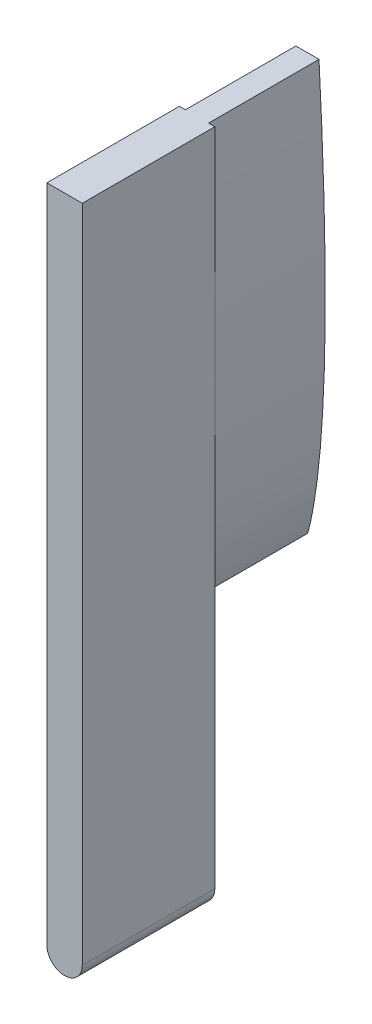
ISO-10303-21;
HEADER;
FILE_DESCRIPTION(('STEP AP214'),'2;1');
FILE_NAME('part.step','',(''),(''),'','','');
FILE_SCHEMA(('AUTOMOTIVE_DESIGN { 1 0 10303 214 1 1 1 1 }'));
ENDSEC;
DATA;
#1=APPLICATION_CONTEXT('core data for automotive mechanical design processes');
#2=APPLICATION_PROTOCOL_DEFINITION('international standard','automotive_design',2000,#1);
#3=PRODUCT_CONTEXT('',#1,'mechanical');
#4=PRODUCT('Part','Part','',(#3));
#5=PRODUCT_RELATED_PRODUCT_CATEGORY('part','',(#4));
#6=PRODUCT_DEFINITION_FORMATION('','',#4);
#7=PRODUCT_DEFINITION_CONTEXT('part definition',#1,'design');
#8=PRODUCT_DEFINITION('design','',#6,#7);
#9=PRODUCT_DEFINITION_SHAPE('','',#8);
#10=(LENGTH_UNIT() NAMED_UNIT(*) SI_UNIT(.MILLI.,.METRE.));
#11=(NAMED_UNIT(*) PLANE_ANGLE_UNIT() SI_UNIT($,.RADIAN.));
#12=(NAMED_UNIT(*) SI_UNIT($,.STERADIAN.) SOLID_ANGLE_UNIT());
#13=UNCERTAINTY_MEASURE_WITH_UNIT(LENGTH_MEASURE(1.E-05),#10,'distance_accuracy_value','');
#14=(GEOMETRIC_REPRESENTATION_CONTEXT(3) GLOBAL_UNCERTAINTY_ASSIGNED_CONTEXT((#13)) GLOBAL_UNIT_ASSIGNED_CONTEXT((#10,
#11,#12)) REPRESENTATION_CONTEXT('',''));
#15=CARTESIAN_POINT('',(0.,0.,0.));
#16=DIRECTION('',(0.,0.,1.));
#17=DIRECTION('',(1.,0.,0.));
#18=AXIS2_PLACEMENT_3D('',#15,#16,#17);
#19=CARTESIAN_POINT('',(0.0298945542330487,602.999999999983,24.6313387531903));
#20=DIRECTION('',(0.,0.,-1.));
#21=DIRECTION('',(-1.,0.,0.));
#22=AXIS2_PLACEMENT_3D('',#19,#20,#21);
#23=PLANE('',#22);
#24=CARTESIAN_POINT('',(0.0409976345272383,625.076764298735,24.6313387531903));
#25=CARTESIAN_POINT('',(-0.0708409013817099,625.459248904981,24.6313387531903));
#26=CARTESIAN_POINT('',(-0.163415051881224,625.843948539452,24.6313387531903));
#27=CARTESIAN_POINT('',(-0.33153675014114,626.615305535302,24.6313387531903));
#28=CARTESIAN_POINT('',(-0.406338832177334,627.002048610685,24.6313387531903));
#29=CARTESIAN_POINT('',(-0.614008944417072,628.164202165491,24.6313387531903));
#30=CARTESIAN_POINT('',(-0.728805434879599,628.941690519176,24.6313387531903));
#31=CARTESIAN_POINT('',(-1.02951816560601,631.279177552711,24.6313387531903));
#32=CARTESIAN_POINT('',(-1.16831944879958,632.844593532805,24.6313387531903));
#33=CARTESIAN_POINT('',(-1.37765882978531,635.98327442662,24.6313387531903));
#34=CARTESIAN_POINT('',(-1.4480325647783,637.557347723028,24.6313387531903));
#35=CARTESIAN_POINT('',(-1.54189304231198,640.707003282898,24.6313387531903));
#36=CARTESIAN_POINT('',(-1.56544765614516,642.28191223816,24.6313387531903));
#37=CARTESIAN_POINT('',(-1.58360924526535,647.006821425807,24.6313387531903));
#38=CARTESIAN_POINT('',(-1.52623600884216,650.157618772716,24.6313387531903));
#39=CARTESIAN_POINT('',(-1.33237645711837,656.455957524906,24.6313387531903));
#40=CARTESIAN_POINT('',(-1.19380236365322,659.603511067183,24.6313387531903));
#41=CARTESIAN_POINT('',(-1.02779046396842,662.749999999983,24.6313387531903));
#42=B_SPLINE_CURVE_WITH_KNOTS('',3,(#24,#25,#26,#27,#28,#29,#30,#31,#32,#33,#34,#35,#36,#37,#38,
#39,#40,#41),.UNSPECIFIED.,.F.,.F.,(4,2,2,2,2,2,2,2,4),(0.,0.0312500000000041,
0.0625000000000081,0.125000000000008,0.250000000000007,0.375000000000005,0.500000000000004,
0.750000000000002,1.),.UNSPECIFIED.);
#43=CARTESIAN_POINT('',(-1.02779046396842,662.749999999983,24.6313387531902));
#44=VERTEX_POINT('',#43);
#45=CARTESIAN_POINT('',(-1.57306805764736,644.82352516353,24.6313387531902));
#46=VERTEX_POINT('',#45);
#47=EDGE_CURVE('E230',#44,#46,#42,.F.);
#48=ORIENTED_EDGE('',*,*,#47,.T.);
#49=DIRECTION('',(0.,-1.,0.));
#50=VECTOR('',#49,1.);
#51=CARTESIAN_POINT('',(-1.57306805764735,662.749999999983,24.6313387531902));
#52=LINE('',#51,#50);
#53=CARTESIAN_POINT('',(-1.57306805764735,662.749999999983,24.6313387531902));
#54=VERTEX_POINT('',#53);
#55=EDGE_CURVE('E139',#54,#46,#52,.T.);
#56=ORIENTED_EDGE('',*,*,#55,.F.);
#57=DIRECTION('',(-1.,0.,0.));
#58=VECTOR('',#57,1.);
#59=CARTESIAN_POINT('',(1.63285716611346,662.749999999983,24.6313387531902));
#60=LINE('',#59,#58);
#61=EDGE_CURVE('E143',#44,#54,#60,.T.);
#62=ORIENTED_EDGE('',*,*,#61,.F.);
#63=EDGE_LOOP('',(#48,#56,#62));
#64=FACE_BOUND('',#63,.T.);
#65=ADVANCED_FACE('F35',(#64),#23,.T.);
#66=CARTESIAN_POINT('',(1.06690047121905,662.749999999983,24.6313387531903));
#67=CARTESIAN_POINT('',(1.23650385175241,659.603485125921,24.6313387531903));
#68=CARTESIAN_POINT('',(1.37867081888815,656.455796636478,24.6313387531903));
#69=CARTESIAN_POINT('',(1.57969897015707,650.156856183506,24.6313387531903));
#70=CARTESIAN_POINT('',(1.64064416120639,647.006539015094,24.6313387531903));
#71=CARTESIAN_POINT('',(1.62779363735582,642.280065577221,24.6313387531903));
#72=CARTESIAN_POINT('',(1.60596701321061,640.704411435351,24.6313387531903));
#73=CARTESIAN_POINT('',(1.51576118029368,637.558590500096,24.6313387531903));
#74=CARTESIAN_POINT('',(1.44733954392402,635.987803898651,24.6313387531903));
#75=CARTESIAN_POINT('',(1.24195574463996,632.85247335861,24.6313387531903));
#76=CARTESIAN_POINT('',(1.10520878535501,631.287909819293,24.6313387531903));
#77=CARTESIAN_POINT('',(0.807374158956095,628.949508907273,24.6313387531903));
#78=CARTESIAN_POINT('',(0.693510345911493,628.171370391667,24.6313387531903));
#79=CARTESIAN_POINT('',(0.487056781908678,627.007410330405,24.6313387531903));
#80=CARTESIAN_POINT('',(0.412632367849736,626.619934288067,24.6313387531903));
#81=CARTESIAN_POINT('',(0.245133832844769,625.846680816435,24.6313387531903));
#82=CARTESIAN_POINT('',(0.152824443736055,625.460833735457,24.6313387531903));
#83=CARTESIAN_POINT('',(0.0409976345273616,625.076764298736,24.6313387531903));
#84=B_SPLINE_CURVE_WITH_KNOTS('',3,(#66,#67,#68,#69,#70,#71,#72,#73,#74,#75,#76,#77,#78,#79,#80,
#81,#82,#83),.UNSPECIFIED.,.F.,.F.,(4,2,2,2,2,2,2,2,4),(0.,0.249999999999998,0.499999999999996,
0.624999999999995,0.749999999999994,0.874999999999992,0.937499999999992,0.968749999999996,1.),.UNSPECIFIED.);
#85=CARTESIAN_POINT('',(1.63285716611346,644.537559857474,24.6313387531902));
#86=VERTEX_POINT('',#85);
#87=CARTESIAN_POINT('',(1.06690047121905,662.749999999983,24.6313387531902));
#88=VERTEX_POINT('',#87);
#89=EDGE_CURVE('E47',#86,#88,#84,.F.);
#90=ORIENTED_EDGE('',*,*,#89,.T.);
#91=CARTESIAN_POINT('',(1.63285716611346,662.749999999983,24.6313387531902));
#92=VERTEX_POINT('',#91);
#93=EDGE_CURVE('E145',#92,#88,#60,.T.);
#94=ORIENTED_EDGE('',*,*,#93,.F.);
#95=DIRECTION('',(0.,1.,0.));
#96=VECTOR('',#95,1.);
#97=CARTESIAN_POINT('',(1.63285716611346,602.999999999983,24.6313387531902));
#98=LINE('',#97,#96);
#99=EDGE_CURVE('E138',#86,#92,#98,.T.);
#100=ORIENTED_EDGE('',*,*,#99,.F.);
#101=EDGE_LOOP('',(#90,#94,#100));
#102=FACE_BOUND('',#101,.T.);
#103=ADVANCED_FACE('F228',(#102),#23,.T.);
#104=CARTESIAN_POINT('',(0.0298945542330487,602.999999999983,24.6313387531902));
#105=DIRECTION('',(0.,0.,-1.));
#106=DIRECTION('',(-1.,0.,0.));
#107=AXIS2_PLACEMENT_3D('',#104,#105,#106);
#108=CIRCLE('',#107,1.60296261188041);
#109=CARTESIAN_POINT('',(-1.57306805764736,602.999999999983,24.6313387531902));
#110=VERTEX_POINT('',#109);
#111=CARTESIAN_POINT('',(1.63285716611346,602.999999999983,24.6313387531902));
#112=VERTEX_POINT('',#111);
#113=EDGE_CURVE('E133',#110,#112,#108,.F.);
#114=ORIENTED_EDGE('',*,*,#113,.F.);
#115=CARTESIAN_POINT('',(-1.57306805764736,644.569367318791,24.6313387531902));
#116=VERTEX_POINT('',#115);
#117=EDGE_CURVE('E314',#116,#110,#52,.T.);
#118=ORIENTED_EDGE('',*,*,#117,.F.);
#119=CARTESIAN_POINT('',(0.0409976345272383,625.076764298735,24.6313387531903));
#120=VERTEX_POINT('',#119);
#121=EDGE_CURVE('E235',#116,#120,#42,.F.);
#122=ORIENTED_EDGE('',*,*,#121,.T.);
#123=CARTESIAN_POINT('',(1.63285716611346,644.35458168479,24.6313387531902));
#124=VERTEX_POINT('',#123);
#125=EDGE_CURVE('E11',#120,#124,#84,.F.);
#126=ORIENTED_EDGE('',*,*,#125,.T.);
#127=EDGE_CURVE('E124',#112,#124,#98,.T.);
#128=ORIENTED_EDGE('',*,*,#127,.F.);
#129=EDGE_LOOP('',(#114,#118,#122,#126,#128));
#130=FACE_BOUND('',#129,.T.);
#131=ADVANCED_FACE('F141',(#130),#23,.T.);
#132=CARTESIAN_POINT('',(0.0409976345272383,625.076764298735,72.9938664508114));
#133=CARTESIAN_POINT('',(-0.0708409013817099,625.459248904981,72.9938664508114));
#134=CARTESIAN_POINT('',(-0.163415051881224,625.843948539452,72.9938664508114));
#135=CARTESIAN_POINT('',(-0.33153675014114,626.615305535302,72.9938664508114));
#136=CARTESIAN_POINT('',(-0.406338832177334,627.002048610685,72.9938664508114));
#137=CARTESIAN_POINT('',(-0.614008944417072,628.164202165491,72.9938664508114));
#138=CARTESIAN_POINT('',(-0.728805434879599,628.941690519176,72.9938664508114));
#139=CARTESIAN_POINT('',(-1.02951816560601,631.279177552711,72.9938664508114));
#140=CARTESIAN_POINT('',(-1.16831944879958,632.844593532805,72.9938664508114));
#141=CARTESIAN_POINT('',(-1.37765882978531,635.98327442662,72.9938664508114));
#142=CARTESIAN_POINT('',(-1.4480325647783,637.557347723028,72.9938664508114));
#143=CARTESIAN_POINT('',(-1.54189304231198,640.707003282898,72.9938664508114));
#144=CARTESIAN_POINT('',(-1.56544765614516,642.28191223816,72.9938664508114));
#145=CARTESIAN_POINT('',(-1.58360924526535,647.006821425807,72.9938664508114));
#146=CARTESIAN_POINT('',(-1.52623600884216,650.157618772716,72.9938664508114));
#147=CARTESIAN_POINT('',(-1.33237645711837,656.455957524906,72.9938664508114));
#148=CARTESIAN_POINT('',(-1.19380236365322,659.603511067183,72.9938664508114));
#149=CARTESIAN_POINT('',(-1.02779046396842,662.749999999983,72.9938664508114));
#150=B_SPLINE_CURVE_WITH_KNOTS('',3,(#132,#133,#134,#135,#136,#137,#138,#139,#140,#141,#142,
#143,#144,#145,#146,#147,#148,#149),.UNSPECIFIED.,.F.,.F.,(4,2,2,2,2,2,2,2,4),(0.,
0.0312500000000041,0.0625000000000081,0.125000000000008,0.250000000000007,0.375000000000005,
0.500000000000004,0.750000000000002,1.),.UNSPECIFIED.);
#151=DIRECTION('',(0.,0.,-1.));
#152=VECTOR('',#151,1.);
#153=SURFACE_OF_LINEAR_EXTRUSION('',#150,#152);
#154=DIRECTION('',(0.,0.,-1.));
#155=VECTOR('',#154,1.);
#156=CARTESIAN_POINT('',(-1.02779046396842,662.749999999983,72.9938664508114));
#157=LINE('',#156,#155);
#158=CARTESIAN_POINT('',(-1.02779046396842,662.749999999983,14.6313387531903));
#159=VERTEX_POINT('',#158);
#160=EDGE_CURVE('E236',#44,#159,#157,.T.);
#161=ORIENTED_EDGE('',*,*,#160,.T.);
#162=CARTESIAN_POINT('',(-1.02779046396842,662.749999999983,14.6313387531903));
#163=CARTESIAN_POINT('',(-1.19380236365322,659.603511067183,14.6313387531903));
#164=CARTESIAN_POINT('',(-1.33237645711837,656.455957524906,14.6313387531903));
#165=CARTESIAN_POINT('',(-1.52623600884216,650.157618772716,14.6313387531903));
#166=CARTESIAN_POINT('',(-1.58360924526535,647.006821425807,14.6313387531903));
#167=CARTESIAN_POINT('',(-1.56544765614516,642.28191223816,14.6313387531903));
#168=CARTESIAN_POINT('',(-1.54189304231198,640.707003282898,14.6313387531903));
#169=CARTESIAN_POINT('',(-1.4480325647783,637.557347723028,14.6313387531903));
#170=CARTESIAN_POINT('',(-1.37765882978531,635.98327442662,14.6313387531903));
#171=CARTESIAN_POINT('',(-1.16831944879958,632.844593532805,14.6313387531903));
#172=CARTESIAN_POINT('',(-1.02951816560601,631.279177552711,14.6313387531903));
#173=CARTESIAN_POINT('',(-0.728805434879599,628.941690519176,14.6313387531903));
#174=CARTESIAN_POINT('',(-0.614008944417072,628.164202165491,14.6313387531903));
#175=CARTESIAN_POINT('',(-0.406338832177334,627.002048610685,14.6313387531903));
#176=CARTESIAN_POINT('',(-0.33153675014114,626.615305535302,14.6313387531903));
#177=CARTESIAN_POINT('',(-0.163415051881224,625.843948539452,14.6313387531903));
#178=CARTESIAN_POINT('',(-0.0708409013817099,625.459248904981,14.6313387531903));
#179=CARTESIAN_POINT('',(0.0409976345272383,625.076764298735,14.6313387531903));
#180=B_SPLINE_CURVE_WITH_KNOTS('',3,(#162,#163,#164,#165,#166,#167,#168,#169,#170,#171,#172,
#173,#174,#175,#176,#177,#178,#179),.UNSPECIFIED.,.F.,.F.,(4,2,2,2,2,2,2,2,4),(0.,
0.249999999999998,0.499999999999996,0.624999999999995,0.749999999999993,0.874999999999992,
0.937499999999992,0.968749999999996,1.),.UNSPECIFIED.);
#181=CARTESIAN_POINT('',(0.0409976345273616,625.076764298736,14.6313387531903));
#182=VERTEX_POINT('',#181);
#183=EDGE_CURVE('E217',#182,#159,#180,.F.);
#184=ORIENTED_EDGE('',*,*,#183,.F.);
#185=DIRECTION('',(0.,0.,-1.));
#186=VECTOR('',#185,1.);
#187=CARTESIAN_POINT('',(0.0409976345272383,625.076764298735,72.9938664508114));
#188=LINE('',#187,#186);
#189=EDGE_CURVE('E239',#120,#182,#188,.T.);
#190=ORIENTED_EDGE('',*,*,#189,.F.);
#191=ORIENTED_EDGE('',*,*,#121,.F.);
#192=CARTESIAN_POINT('',(-1.57306805764736,644.57029770419,24.6313387531902));
#193=VERTEX_POINT('',#192);
#194=EDGE_CURVE('E214',#193,#116,#52,.T.);
#195=ORIENTED_EDGE('',*,*,#194,.F.);
#196=CARTESIAN_POINT('',(-1.57306858755521,644.57029770404,24.6313387531903));
#197=CARTESIAN_POINT('',(-1.57311631046774,644.65439739438,24.6313387531903));
#198=CARTESIAN_POINT('',(-1.57311611930975,644.738497562438,24.6313387531903));
#199=CARTESIAN_POINT('',(-1.57306858352999,644.822598160908,24.6313387531903));
#200=B_SPLINE_CURVE_WITH_KNOTS('',3,(#196,#197,#198,#199),.UNSPECIFIED.,.F.,.F.,(4,4),
(0.518873435176188,0.525547897615271),.UNSPECIFIED.);
#201=CARTESIAN_POINT('',(-1.57306805764736,644.822598160759,24.6313387531902));
#202=VERTEX_POINT('',#201);
#203=EDGE_CURVE('E209',#202,#193,#200,.F.);
#204=ORIENTED_EDGE('',*,*,#203,.F.);
#205=EDGE_CURVE('E163',#46,#202,#52,.T.);
#206=ORIENTED_EDGE('',*,*,#205,.F.);
#207=ORIENTED_EDGE('',*,*,#47,.F.);
#208=EDGE_LOOP('',(#161,#184,#190,#191,#195,#204,#206,#207));
#209=FACE_BOUND('',#208,.T.);
#210=ADVANCED_FACE('F210',(#209),#153,.T.);
#211=CARTESIAN_POINT('',(-1.02779046396842,662.749999999983,72.9938664508114));
#212=DIRECTION('',(0.,1.,0.));
#213=DIRECTION('',(-1.,0.,0.));
#214=AXIS2_PLACEMENT_3D('',#211,#212,#213);
#215=PLANE('',#214);
#216=DIRECTION('',(0.,0.,-1.));
#217=VECTOR('',#216,1.);
#218=CARTESIAN_POINT('',(1.06690047121905,662.749999999983,72.9938664508114));
#219=LINE('',#218,#217);
#220=CARTESIAN_POINT('',(1.06690047121905,662.749999999983,14.6313387531903));
#221=VERTEX_POINT('',#220);
#222=EDGE_CURVE('E223',#88,#221,#219,.T.);
#223=ORIENTED_EDGE('',*,*,#222,.T.);
#224=DIRECTION('',(1.,0.,0.));
#225=VECTOR('',#224,1.);
#226=CARTESIAN_POINT('',(-1.02779046396842,662.749999999983,14.6313387531903));
#227=LINE('',#226,#225);
#228=EDGE_CURVE('E294',#159,#221,#227,.T.);
#229=ORIENTED_EDGE('',*,*,#228,.F.);
#230=ORIENTED_EDGE('',*,*,#160,.F.);
#231=ORIENTED_EDGE('',*,*,#61,.T.);
#232=DIRECTION('',(0.,0.,1.));
#233=VECTOR('',#232,1.);
#234=CARTESIAN_POINT('',(-1.57306805764735,662.749999999983,-41.8056450503321));
#235=LINE('',#234,#233);
#236=CARTESIAN_POINT('',(-1.57306805764735,662.749999999983,36.6313387531903));
#237=VERTEX_POINT('',#236);
#238=EDGE_CURVE('E151',#54,#237,#235,.T.);
#239=ORIENTED_EDGE('',*,*,#238,.T.);
#240=DIRECTION('',(-1.,0.,0.));
#241=VECTOR('',#240,1.);
#242=CARTESIAN_POINT('',(1.63285716611346,662.749999999983,36.6313387531903));
#243=LINE('',#242,#241);
#244=CARTESIAN_POINT('',(1.63285716611346,662.749999999983,36.6313387531903));
#245=VERTEX_POINT('',#244);
#246=EDGE_CURVE('E54',#245,#237,#243,.T.);
#247=ORIENTED_EDGE('',*,*,#246,.F.);
#248=DIRECTION('',(0.,0.,1.));
#249=VECTOR('',#248,1.);
#250=CARTESIAN_POINT('',(1.63285716611346,662.749999999983,-41.8056450503321));
#251=LINE('',#250,#249);
#252=EDGE_CURVE('E154',#92,#245,#251,.T.);
#253=ORIENTED_EDGE('',*,*,#252,.F.);
#254=ORIENTED_EDGE('',*,*,#93,.T.);
#255=EDGE_LOOP('',(#223,#229,#230,#231,#239,#247,#253,#254));
#256=FACE_BOUND('',#255,.T.);
#257=ADVANCED_FACE('F220',(#256),#215,.T.);
#258=CARTESIAN_POINT('',(1.06690047121905,662.749999999983,72.9938664508114));
#259=CARTESIAN_POINT('',(1.23650385175241,659.603485125921,72.9938664508114));
#260=CARTESIAN_POINT('',(1.37867081888815,656.455796636478,72.9938664508114));
#261=CARTESIAN_POINT('',(1.57969897015707,650.156856183506,72.9938664508114));
#262=CARTESIAN_POINT('',(1.64064416120639,647.006539015094,72.9938664508114));
#263=CARTESIAN_POINT('',(1.62779363735582,642.280065577221,72.9938664508114));
#264=CARTESIAN_POINT('',(1.60596701321061,640.704411435351,72.9938664508114));
#265=CARTESIAN_POINT('',(1.51576118029368,637.558590500096,72.9938664508114));
#266=CARTESIAN_POINT('',(1.44733954392402,635.987803898651,72.9938664508114));
#267=CARTESIAN_POINT('',(1.24195574463996,632.85247335861,72.9938664508114));
#268=CARTESIAN_POINT('',(1.10520878535501,631.287909819293,72.9938664508114));
#269=CARTESIAN_POINT('',(0.807374158956095,628.949508907273,72.9938664508114));
#270=CARTESIAN_POINT('',(0.693510345911493,628.171370391667,72.9938664508114));
#271=CARTESIAN_POINT('',(0.487056781908678,627.007410330405,72.9938664508114));
#272=CARTESIAN_POINT('',(0.412632367849736,626.619934288067,72.9938664508114));
#273=CARTESIAN_POINT('',(0.245133832844769,625.846680816435,72.9938664508114));
#274=CARTESIAN_POINT('',(0.152824443736055,625.460833735457,72.9938664508114));
#275=CARTESIAN_POINT('',(0.0409976345273616,625.076764298736,72.9938664508114));
#276=B_SPLINE_CURVE_WITH_KNOTS('',3,(#258,#259,#260,#261,#262,#263,#264,#265,#266,#267,#268,
#269,#270,#271,#272,#273,#274,#275),.UNSPECIFIED.,.F.,.F.,(4,2,2,2,2,2,2,2,4),(0.,
0.249999999999998,0.499999999999996,0.624999999999995,0.749999999999994,0.874999999999992,
0.937499999999992,0.968749999999996,1.),.UNSPECIFIED.);
#277=DIRECTION('',(0.,0.,-1.));
#278=VECTOR('',#277,1.);
#279=SURFACE_OF_LINEAR_EXTRUSION('',#276,#278);
#280=ORIENTED_EDGE('',*,*,#189,.T.);
#281=CARTESIAN_POINT('',(0.0409976345273616,625.076764298736,14.6313387531903));
#282=CARTESIAN_POINT('',(0.152824443736055,625.460833735457,14.6313387531903));
#283=CARTESIAN_POINT('',(0.245133832844769,625.846680816435,14.6313387531903));
#284=CARTESIAN_POINT('',(0.412632367849736,626.619934288067,14.6313387531903));
#285=CARTESIAN_POINT('',(0.487056781908678,627.007410330405,14.6313387531903));
#286=CARTESIAN_POINT('',(0.693510345911493,628.171370391667,14.6313387531903));
#287=CARTESIAN_POINT('',(0.807374158956095,628.949508907273,14.6313387531903));
#288=CARTESIAN_POINT('',(1.10520878535501,631.287909819293,14.6313387531903));
#289=CARTESIAN_POINT('',(1.24195574463996,632.85247335861,14.6313387531903));
#290=CARTESIAN_POINT('',(1.44733954392402,635.987803898651,14.6313387531903));
#291=CARTESIAN_POINT('',(1.51576118029368,637.558590500096,14.6313387531903));
#292=CARTESIAN_POINT('',(1.60596701321061,640.704411435351,14.6313387531903));
#293=CARTESIAN_POINT('',(1.62779363735582,642.280065577221,14.6313387531903));
#294=CARTESIAN_POINT('',(1.64064416120639,647.006539015094,14.6313387531903));
#295=CARTESIAN_POINT('',(1.57969897015707,650.156856183506,14.6313387531903));
#296=CARTESIAN_POINT('',(1.37867081888815,656.455796636478,14.6313387531903));
#297=CARTESIAN_POINT('',(1.23650385175241,659.603485125921,14.6313387531903));
#298=CARTESIAN_POINT('',(1.06690047121905,662.749999999983,14.6313387531903));
#299=B_SPLINE_CURVE_WITH_KNOTS('',3,(#281,#282,#283,#284,#285,#286,#287,#288,#289,#290,#291,
#292,#293,#294,#295,#296,#297,#298),.UNSPECIFIED.,.F.,.F.,(4,2,2,2,2,2,2,2,4),(0.,
0.0312500000000041,0.0625000000000081,0.125000000000008,0.250000000000006,0.375000000000005,
0.500000000000004,0.750000000000002,1.),.UNSPECIFIED.);
#300=EDGE_CURVE('E215',#221,#182,#299,.F.);
#301=ORIENTED_EDGE('',*,*,#300,.F.);
#302=ORIENTED_EDGE('',*,*,#222,.F.);
#303=ORIENTED_EDGE('',*,*,#89,.F.);
#304=CARTESIAN_POINT('',(1.63285716611346,644.534713657174,24.6313387531902));
#305=VERTEX_POINT('',#304);
#306=EDGE_CURVE('E204',#305,#86,#84,.F.);
#307=ORIENTED_EDGE('',*,*,#306,.F.);
#308=CARTESIAN_POINT('',(1.63285832884858,644.534713657407,24.6313387531903));
#309=CARTESIAN_POINT('',(1.63288208977686,644.475619385729,24.6313387531903));
#310=CARTESIAN_POINT('',(1.63288215699337,644.416524875505,24.6313387531903));
#311=CARTESIAN_POINT('',(1.63285833296578,644.357430127932,24.6313387531903));
#312=B_SPLINE_CURVE_WITH_KNOTS('',3,(#308,#309,#310,#311),.UNSPECIFIED.,.F.,.F.,(4,4),
(0.482038212244392,0.486726915344385),.UNSPECIFIED.);
#313=CARTESIAN_POINT('',(1.63285833296578,644.357430127932,24.6313387531903));
#314=VERTEX_POINT('',#313);
#315=EDGE_CURVE('E157',#314,#305,#312,.F.);
#316=ORIENTED_EDGE('',*,*,#315,.F.);
#317=EDGE_CURVE('E45',#124,#314,#84,.F.);
#318=ORIENTED_EDGE('',*,*,#317,.F.);
#319=ORIENTED_EDGE('',*,*,#125,.F.);
#320=EDGE_LOOP('',(#280,#301,#302,#303,#307,#316,#318,#319));
#321=FACE_BOUND('',#320,.T.);
#322=ADVANCED_FACE('F232',(#321),#279,.T.);
#323=CARTESIAN_POINT('',(1.88005261262704,643.343176240469,14.6313387531903));
#324=DIRECTION('',(0.,0.,1.));
#325=DIRECTION('',(1.,0.,0.));
#326=AXIS2_PLACEMENT_3D('',#323,#324,#325);
#327=PLANE('',#326);
#328=ORIENTED_EDGE('',*,*,#183,.T.);
#329=ORIENTED_EDGE('',*,*,#228,.T.);
#330=ORIENTED_EDGE('',*,*,#300,.T.);
#331=EDGE_LOOP('',(#328,#329,#330));
#332=FACE_BOUND('',#331,.T.);
#333=ADVANCED_FACE('F264',(#332),#327,.F.);
#334=CARTESIAN_POINT('',(0.0298945542330487,602.999999999983,-41.8056450503321));
#335=DIRECTION('',(0.,0.,1.));
#336=DIRECTION('',(1.,0.,0.));
#337=AXIS2_PLACEMENT_3D('',#334,#335,#336);
#338=CYLINDRICAL_SURFACE('',#337,1.60296261188041);
#339=ORIENTED_EDGE('',*,*,#113,.T.);
#340=DIRECTION('',(0.,0.,1.));
#341=VECTOR('',#340,1.);
#342=CARTESIAN_POINT('',(1.63285716611346,602.999999999983,-41.8056450503321));
#343=LINE('',#342,#341);
#344=CARTESIAN_POINT('',(1.63285716611346,602.999999999983,36.6313387531903));
#345=VERTEX_POINT('',#344);
#346=EDGE_CURVE('E120',#112,#345,#343,.T.);
#347=ORIENTED_EDGE('',*,*,#346,.T.);
#348=CARTESIAN_POINT('',(0.0298945542330487,602.999999999983,36.6313387531903));
#349=DIRECTION('',(0.,0.,1.));
#350=DIRECTION('',(1.,0.,0.));
#351=AXIS2_PLACEMENT_3D('',#348,#349,#350);
#352=CIRCLE('',#351,1.60296261188041);
#353=CARTESIAN_POINT('',(-1.57306805764736,602.999999999983,36.6313387531903));
#354=VERTEX_POINT('',#353);
#355=EDGE_CURVE('E150',#354,#345,#352,.T.);
#356=ORIENTED_EDGE('',*,*,#355,.F.);
#357=DIRECTION('',(0.,0.,1.));
#358=VECTOR('',#357,1.);
#359=CARTESIAN_POINT('',(-1.57306805764736,602.999999999983,-41.8056450503321));
#360=LINE('',#359,#358);
#361=EDGE_CURVE('E135',#110,#354,#360,.T.);
#362=ORIENTED_EDGE('',*,*,#361,.F.);
#363=EDGE_LOOP('',(#339,#347,#356,#362));
#364=FACE_BOUND('',#363,.T.);
#365=ADVANCED_FACE('F134',(#364),#338,.T.);
#366=CARTESIAN_POINT('',(-1.57306805764735,662.749999999983,-41.8056450503321));
#367=DIRECTION('',(-1.,0.,0.));
#368=DIRECTION('',(0.,-1.,0.));
#369=AXIS2_PLACEMENT_3D('',#366,#367,#368);
#370=PLANE('',#369);
#371=ORIENTED_EDGE('',*,*,#55,.T.);
#372=ORIENTED_EDGE('',*,*,#205,.T.);
#373=ORIENTED_EDGE('',*,*,#203,.T.);
#374=ORIENTED_EDGE('',*,*,#194,.T.);
#375=ORIENTED_EDGE('',*,*,#117,.T.);
#376=ORIENTED_EDGE('',*,*,#361,.T.);
#377=DIRECTION('',(0.,-1.,0.));
#378=VECTOR('',#377,1.);
#379=CARTESIAN_POINT('',(-1.57306805764735,662.749999999983,36.6313387531903));
#380=LINE('',#379,#378);
#381=EDGE_CURVE('E153',#237,#354,#380,.T.);
#382=ORIENTED_EDGE('',*,*,#381,.F.);
#383=ORIENTED_EDGE('',*,*,#238,.F.);
#384=EDGE_LOOP('',(#371,#372,#373,#374,#375,#376,#382,#383));
#385=FACE_BOUND('',#384,.T.);
#386=ADVANCED_FACE('F174',(#385),#370,.T.);
#387=CARTESIAN_POINT('',(1.63285716611346,602.999999999983,-41.8056450503321));
#388=DIRECTION('',(1.,0.,0.));
#389=DIRECTION('',(0.,1.,0.));
#390=AXIS2_PLACEMENT_3D('',#387,#388,#389);
#391=PLANE('',#390);
#392=ORIENTED_EDGE('',*,*,#127,.T.);
#393=ORIENTED_EDGE('',*,*,#317,.T.);
#394=ORIENTED_EDGE('',*,*,#315,.T.);
#395=ORIENTED_EDGE('',*,*,#306,.T.);
#396=ORIENTED_EDGE('',*,*,#99,.T.);
#397=ORIENTED_EDGE('',*,*,#252,.T.);
#398=DIRECTION('',(0.,1.,0.));
#399=VECTOR('',#398,1.);
#400=CARTESIAN_POINT('',(1.63285716611346,602.999999999983,36.6313387531903));
#401=LINE('',#400,#399);
#402=EDGE_CURVE('E126',#345,#245,#401,.T.);
#403=ORIENTED_EDGE('',*,*,#402,.F.);
#404=ORIENTED_EDGE('',*,*,#346,.F.);
#405=EDGE_LOOP('',(#392,#393,#394,#395,#396,#397,#403,#404));
#406=FACE_BOUND('',#405,.T.);
#407=ADVANCED_FACE('F122',(#406),#391,.T.);
#408=CARTESIAN_POINT('',(0.0298945542330487,602.999999999983,36.6313387531903));
#409=DIRECTION('',(0.,0.,-1.));
#410=DIRECTION('',(-1.,0.,0.));
#411=AXIS2_PLACEMENT_3D('',#408,#409,#410);
#412=PLANE('',#411);
#413=ORIENTED_EDGE('',*,*,#355,.T.);
#414=ORIENTED_EDGE('',*,*,#402,.T.);
#415=ORIENTED_EDGE('',*,*,#246,.T.);
#416=ORIENTED_EDGE('',*,*,#381,.T.);
#417=EDGE_LOOP('',(#413,#414,#415,#416));
#418=FACE_BOUND('',#417,.T.);
#419=ADVANCED_FACE('F173',(#418),#412,.F.);
#420=CLOSED_SHELL('',(#65,#103,#131,#210,#257,#322,#333,#365,#386,#407,#419));
#421=MANIFOLD_SOLID_BREP('B2',#420);
#422=ADVANCED_BREP_SHAPE_REPRESENTATION('',(#18,#421),#14);
#423=SHAPE_DEFINITION_REPRESENTATION(#9,#422);
ENDSEC;
END-ISO-10303-21;
